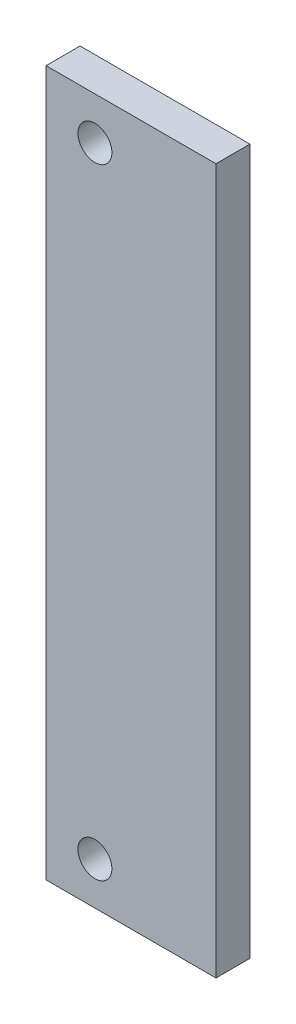
ISO-10303-21;
HEADER;
FILE_DESCRIPTION(('STEP AP214'),'2;1');
FILE_NAME('part.step','',(''),(''),'','','');
FILE_SCHEMA(('AUTOMOTIVE_DESIGN { 1 0 10303 214 1 1 1 1 }'));
ENDSEC;
DATA;
#1=APPLICATION_CONTEXT('core data for automotive mechanical design processes');
#2=APPLICATION_PROTOCOL_DEFINITION('international standard','automotive_design',2000,#1);
#3=PRODUCT_CONTEXT('',#1,'mechanical');
#4=PRODUCT('Part','Part','',(#3));
#5=PRODUCT_RELATED_PRODUCT_CATEGORY('part','',(#4));
#6=PRODUCT_DEFINITION_FORMATION('','',#4);
#7=PRODUCT_DEFINITION_CONTEXT('part definition',#1,'design');
#8=PRODUCT_DEFINITION('design','',#6,#7);
#9=PRODUCT_DEFINITION_SHAPE('','',#8);
#10=(LENGTH_UNIT() NAMED_UNIT(*) SI_UNIT(.MILLI.,.METRE.));
#11=(NAMED_UNIT(*) PLANE_ANGLE_UNIT() SI_UNIT($,.RADIAN.));
#12=(NAMED_UNIT(*) SI_UNIT($,.STERADIAN.) SOLID_ANGLE_UNIT());
#13=UNCERTAINTY_MEASURE_WITH_UNIT(LENGTH_MEASURE(1.E-05),#10,'distance_accuracy_value','');
#14=(GEOMETRIC_REPRESENTATION_CONTEXT(3) GLOBAL_UNCERTAINTY_ASSIGNED_CONTEXT((#13)) GLOBAL_UNIT_ASSIGNED_CONTEXT((#10,
#11,#12)) REPRESENTATION_CONTEXT('',''));
#15=CARTESIAN_POINT('',(0.,0.,0.));
#16=DIRECTION('',(0.,0.,1.));
#17=DIRECTION('',(1.,0.,0.));
#18=AXIS2_PLACEMENT_3D('',#15,#16,#17);
#19=CARTESIAN_POINT('',(20.,-83.,4.));
#20=DIRECTION('',(-1.,0.,0.));
#21=DIRECTION('',(0.,0.,1.));
#22=AXIS2_PLACEMENT_3D('',#19,#20,#21);
#23=PLANE('',#22);
#24=DIRECTION('',(0.,1.,0.));
#25=VECTOR('',#24,1.);
#26=CARTESIAN_POINT('',(20.,-83.,-4.));
#27=LINE('',#26,#25);
#28=CARTESIAN_POINT('',(20.,-83.,-4.));
#29=VERTEX_POINT('',#28);
#30=CARTESIAN_POINT('',(20.,83.,-4.));
#31=VERTEX_POINT('',#30);
#32=EDGE_CURVE('E96',#29,#31,#27,.T.);
#33=ORIENTED_EDGE('',*,*,#32,.T.);
#34=DIRECTION('',(0.,0.,-1.));
#35=VECTOR('',#34,1.);
#36=CARTESIAN_POINT('',(20.,83.,4.));
#37=LINE('',#36,#35);
#38=CARTESIAN_POINT('',(20.,83.,4.));
#39=VERTEX_POINT('',#38);
#40=EDGE_CURVE('E11',#39,#31,#37,.T.);
#41=ORIENTED_EDGE('',*,*,#40,.F.);
#42=DIRECTION('',(0.,1.,0.));
#43=VECTOR('',#42,1.);
#44=CARTESIAN_POINT('',(20.,-83.,4.));
#45=LINE('',#44,#43);
#46=CARTESIAN_POINT('',(20.,-83.,4.));
#47=VERTEX_POINT('',#46);
#48=EDGE_CURVE('E84',#47,#39,#45,.T.);
#49=ORIENTED_EDGE('',*,*,#48,.F.);
#50=DIRECTION('',(0.,0.,-1.));
#51=VECTOR('',#50,1.);
#52=CARTESIAN_POINT('',(20.,-83.,4.));
#53=LINE('',#52,#51);
#54=EDGE_CURVE('E92',#47,#29,#53,.T.);
#55=ORIENTED_EDGE('',*,*,#54,.T.);
#56=EDGE_LOOP('',(#33,#41,#49,#55));
#57=FACE_BOUND('',#56,.T.);
#58=ADVANCED_FACE('F33',(#57),#23,.F.);
#59=CARTESIAN_POINT('',(-20.,83.,4.));
#60=DIRECTION('',(0.,-1.,0.));
#61=DIRECTION('',(0.,0.,-1.));
#62=AXIS2_PLACEMENT_3D('',#59,#60,#61);
#63=PLANE('',#62);
#64=DIRECTION('',(-1.,0.,0.));
#65=VECTOR('',#64,1.);
#66=CARTESIAN_POINT('',(-20.,83.,-4.));
#67=LINE('',#66,#65);
#68=CARTESIAN_POINT('',(-20.,83.,-4.));
#69=VERTEX_POINT('',#68);
#70=EDGE_CURVE('E88',#31,#69,#67,.T.);
#71=ORIENTED_EDGE('',*,*,#70,.T.);
#72=DIRECTION('',(0.,0.,-1.));
#73=VECTOR('',#72,1.);
#74=CARTESIAN_POINT('',(-20.,83.,4.));
#75=LINE('',#74,#73);
#76=CARTESIAN_POINT('',(-20.,83.,4.));
#77=VERTEX_POINT('',#76);
#78=EDGE_CURVE('E41',#77,#69,#75,.T.);
#79=ORIENTED_EDGE('',*,*,#78,.F.);
#80=DIRECTION('',(-1.,0.,0.));
#81=VECTOR('',#80,1.);
#82=CARTESIAN_POINT('',(-20.,83.,4.));
#83=LINE('',#82,#81);
#84=EDGE_CURVE('E79',#39,#77,#83,.T.);
#85=ORIENTED_EDGE('',*,*,#84,.F.);
#86=ORIENTED_EDGE('',*,*,#40,.T.);
#87=EDGE_LOOP('',(#71,#79,#85,#86));
#88=FACE_BOUND('',#87,.T.);
#89=ADVANCED_FACE('F87',(#88),#63,.F.);
#90=CARTESIAN_POINT('',(-20.,-83.,4.));
#91=DIRECTION('',(1.,0.,0.));
#92=DIRECTION('',(0.,0.,-1.));
#93=AXIS2_PLACEMENT_3D('',#90,#91,#92);
#94=PLANE('',#93);
#95=DIRECTION('',(0.,-1.,0.));
#96=VECTOR('',#95,1.);
#97=CARTESIAN_POINT('',(-20.,-83.,-4.));
#98=LINE('',#97,#96);
#99=CARTESIAN_POINT('',(-20.,-83.,-4.));
#100=VERTEX_POINT('',#99);
#101=EDGE_CURVE('E66',#69,#100,#98,.T.);
#102=ORIENTED_EDGE('',*,*,#101,.T.);
#103=DIRECTION('',(0.,0.,-1.));
#104=VECTOR('',#103,1.);
#105=CARTESIAN_POINT('',(-20.,-83.,4.));
#106=LINE('',#105,#104);
#107=CARTESIAN_POINT('',(-20.,-83.,4.));
#108=VERTEX_POINT('',#107);
#109=EDGE_CURVE('E89',#108,#100,#106,.T.);
#110=ORIENTED_EDGE('',*,*,#109,.F.);
#111=DIRECTION('',(0.,-1.,0.));
#112=VECTOR('',#111,1.);
#113=CARTESIAN_POINT('',(-20.,-83.,4.));
#114=LINE('',#113,#112);
#115=EDGE_CURVE('E82',#77,#108,#114,.T.);
#116=ORIENTED_EDGE('',*,*,#115,.F.);
#117=ORIENTED_EDGE('',*,*,#78,.T.);
#118=EDGE_LOOP('',(#102,#110,#116,#117));
#119=FACE_BOUND('',#118,.T.);
#120=ADVANCED_FACE('F90',(#119),#94,.F.);
#121=CARTESIAN_POINT('',(-20.,-83.,4.));
#122=DIRECTION('',(0.,1.,0.));
#123=DIRECTION('',(0.,0.,1.));
#124=AXIS2_PLACEMENT_3D('',#121,#122,#123);
#125=PLANE('',#124);
#126=DIRECTION('',(1.,0.,0.));
#127=VECTOR('',#126,1.);
#128=CARTESIAN_POINT('',(-20.,-83.,-4.));
#129=LINE('',#128,#127);
#130=EDGE_CURVE('E72',#100,#29,#129,.T.);
#131=ORIENTED_EDGE('',*,*,#130,.T.);
#132=ORIENTED_EDGE('',*,*,#54,.F.);
#133=DIRECTION('',(1.,0.,0.));
#134=VECTOR('',#133,1.);
#135=CARTESIAN_POINT('',(-20.,-83.,4.));
#136=LINE('',#135,#134);
#137=EDGE_CURVE('E49',#108,#47,#136,.T.);
#138=ORIENTED_EDGE('',*,*,#137,.F.);
#139=ORIENTED_EDGE('',*,*,#109,.T.);
#140=EDGE_LOOP('',(#131,#132,#138,#139));
#141=FACE_BOUND('',#140,.T.);
#142=ADVANCED_FACE('F104',(#141),#125,.F.);
#143=CARTESIAN_POINT('',(0.,0.,4.));
#144=DIRECTION('',(0.,0.,-1.));
#145=DIRECTION('',(-1.,0.,0.));
#146=AXIS2_PLACEMENT_3D('',#143,#144,#145);
#147=PLANE('',#146);
#148=CARTESIAN_POINT('',(-8.5,73.,4.));
#149=DIRECTION('',(0.,0.,1.));
#150=DIRECTION('',(1.,0.,0.));
#151=AXIS2_PLACEMENT_3D('',#148,#149,#150);
#152=CIRCLE('',#151,4.00000000000001);
#153=CARTESIAN_POINT('',(-4.49999999999999,73.,4.));
#154=VERTEX_POINT('',#153);
#155=EDGE_CURVE('E116',#154,#154,#152,.T.);
#156=ORIENTED_EDGE('',*,*,#155,.F.);
#157=EDGE_LOOP('',(#156));
#158=FACE_BOUND('',#157,.T.);
#159=CARTESIAN_POINT('',(-8.49999999999998,-73.,4.));
#160=DIRECTION('',(0.,0.,1.));
#161=DIRECTION('',(-1.,0.,0.));
#162=AXIS2_PLACEMENT_3D('',#159,#160,#161);
#163=CIRCLE('',#162,4.00000000000001);
#164=CARTESIAN_POINT('',(-12.5,-73.,4.));
#165=VERTEX_POINT('',#164);
#166=EDGE_CURVE('E110',#165,#165,#163,.T.);
#167=ORIENTED_EDGE('',*,*,#166,.F.);
#168=EDGE_LOOP('',(#167));
#169=FACE_BOUND('',#168,.T.);
#170=ORIENTED_EDGE('',*,*,#48,.T.);
#171=ORIENTED_EDGE('',*,*,#84,.T.);
#172=ORIENTED_EDGE('',*,*,#115,.T.);
#173=ORIENTED_EDGE('',*,*,#137,.T.);
#174=EDGE_LOOP('',(#170,#171,#172,#173));
#175=FACE_BOUND('',#174,.T.);
#176=ADVANCED_FACE('F80',(#158,#169,#175),#147,.F.);
#177=CARTESIAN_POINT('',(0.,0.,-4.));
#178=DIRECTION('',(0.,0.,-1.));
#179=DIRECTION('',(-1.,0.,0.));
#180=AXIS2_PLACEMENT_3D('',#177,#178,#179);
#181=PLANE('',#180);
#182=CARTESIAN_POINT('',(-8.5,73.,-4.));
#183=DIRECTION('',(0.,0.,1.));
#184=DIRECTION('',(1.,0.,0.));
#185=AXIS2_PLACEMENT_3D('',#182,#183,#184);
#186=CIRCLE('',#185,4.00000000000001);
#187=CARTESIAN_POINT('',(-4.49999999999999,73.,-4.));
#188=VERTEX_POINT('',#187);
#189=EDGE_CURVE('E99',#188,#188,#186,.T.);
#190=ORIENTED_EDGE('',*,*,#189,.T.);
#191=EDGE_LOOP('',(#190));
#192=FACE_BOUND('',#191,.T.);
#193=CARTESIAN_POINT('',(-8.49999999999998,-73.,-4.));
#194=DIRECTION('',(0.,0.,1.));
#195=DIRECTION('',(-1.,0.,0.));
#196=AXIS2_PLACEMENT_3D('',#193,#194,#195);
#197=CIRCLE('',#196,4.00000000000001);
#198=CARTESIAN_POINT('',(-12.5,-73.,-4.));
#199=VERTEX_POINT('',#198);
#200=EDGE_CURVE('E113',#199,#199,#197,.T.);
#201=ORIENTED_EDGE('',*,*,#200,.T.);
#202=EDGE_LOOP('',(#201));
#203=FACE_BOUND('',#202,.T.);
#204=ORIENTED_EDGE('',*,*,#32,.F.);
#205=ORIENTED_EDGE('',*,*,#130,.F.);
#206=ORIENTED_EDGE('',*,*,#101,.F.);
#207=ORIENTED_EDGE('',*,*,#70,.F.);
#208=EDGE_LOOP('',(#204,#205,#206,#207));
#209=FACE_BOUND('',#208,.T.);
#210=ADVANCED_FACE('F107',(#192,#203,#209),#181,.T.);
#211=CARTESIAN_POINT('',(-8.49999999999998,-73.,-4.));
#212=DIRECTION('',(0.,0.,1.));
#213=DIRECTION('',(1.,0.,0.));
#214=AXIS2_PLACEMENT_3D('',#211,#212,#213);
#215=CYLINDRICAL_SURFACE('',#214,4.00000000000001);
#216=ORIENTED_EDGE('',*,*,#200,.F.);
#217=EDGE_LOOP('',(#216));
#218=FACE_BOUND('',#217,.T.);
#219=ORIENTED_EDGE('',*,*,#166,.T.);
#220=EDGE_LOOP('',(#219));
#221=FACE_BOUND('',#220,.T.);
#222=ADVANCED_FACE('F127',(#218,#221),#215,.F.);
#223=CARTESIAN_POINT('',(-8.5,73.,-4.));
#224=DIRECTION('',(0.,0.,1.));
#225=DIRECTION('',(1.,0.,0.));
#226=AXIS2_PLACEMENT_3D('',#223,#224,#225);
#227=CYLINDRICAL_SURFACE('',#226,4.00000000000001);
#228=ORIENTED_EDGE('',*,*,#189,.F.);
#229=EDGE_LOOP('',(#228));
#230=FACE_BOUND('',#229,.T.);
#231=ORIENTED_EDGE('',*,*,#155,.T.);
#232=EDGE_LOOP('',(#231));
#233=FACE_BOUND('',#232,.T.);
#234=ADVANCED_FACE('F124',(#230,#233),#227,.F.);
#235=CLOSED_SHELL('',(#58,#89,#120,#142,#176,#210,#222,#234));
#236=MANIFOLD_SOLID_BREP('B2',#235);
#237=ADVANCED_BREP_SHAPE_REPRESENTATION('',(#18,#236),#14);
#238=SHAPE_DEFINITION_REPRESENTATION(#9,#237);
ENDSEC;
END-ISO-10303-21;
